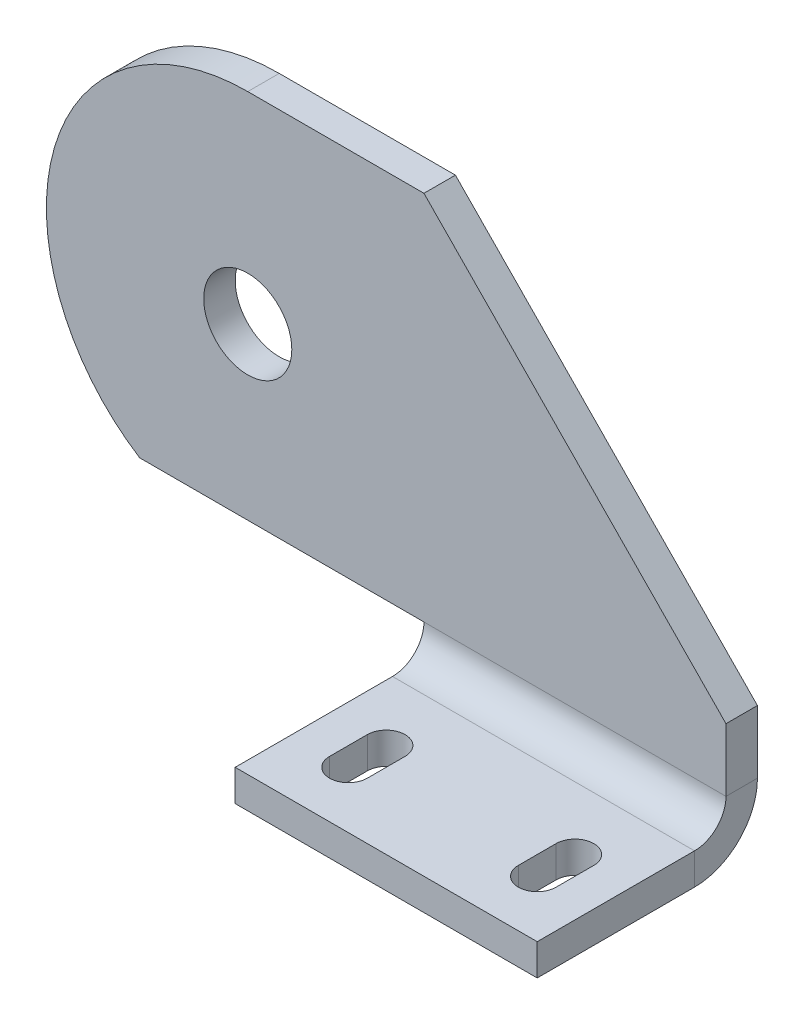
ISO-10303-21;
HEADER;
FILE_DESCRIPTION(('STEP AP214'),'2;1');
FILE_NAME('part.step','',(''),(''),'','','');
FILE_SCHEMA(('AUTOMOTIVE_DESIGN { 1 0 10303 214 1 1 1 1 }'));
ENDSEC;
DATA;
#1=APPLICATION_CONTEXT('core data for automotive mechanical design processes');
#2=APPLICATION_PROTOCOL_DEFINITION('international standard','automotive_design',2000,#1);
#3=PRODUCT_CONTEXT('',#1,'mechanical');
#4=PRODUCT('Part','Part','',(#3));
#5=PRODUCT_RELATED_PRODUCT_CATEGORY('part','',(#4));
#6=PRODUCT_DEFINITION_FORMATION('','',#4);
#7=PRODUCT_DEFINITION_CONTEXT('part definition',#1,'design');
#8=PRODUCT_DEFINITION('design','',#6,#7);
#9=PRODUCT_DEFINITION_SHAPE('','',#8);
#10=(LENGTH_UNIT() NAMED_UNIT(*) SI_UNIT(.MILLI.,.METRE.));
#11=(NAMED_UNIT(*) PLANE_ANGLE_UNIT() SI_UNIT($,.RADIAN.));
#12=(NAMED_UNIT(*) SI_UNIT($,.STERADIAN.) SOLID_ANGLE_UNIT());
#13=UNCERTAINTY_MEASURE_WITH_UNIT(LENGTH_MEASURE(1.E-05),#10,'distance_accuracy_value','');
#14=(GEOMETRIC_REPRESENTATION_CONTEXT(3) GLOBAL_UNCERTAINTY_ASSIGNED_CONTEXT((#13)) GLOBAL_UNIT_ASSIGNED_CONTEXT((#10,
#11,#12)) REPRESENTATION_CONTEXT('',''));
#15=CARTESIAN_POINT('',(0.,0.,0.));
#16=DIRECTION('',(0.,0.,1.));
#17=DIRECTION('',(1.,0.,0.));
#18=AXIS2_PLACEMENT_3D('',#15,#16,#17);
#19=CARTESIAN_POINT('',(-108.,0.,0.));
#20=DIRECTION('',(0.,0.,-1.));
#21=DIRECTION('',(-1.,0.,0.));
#22=AXIS2_PLACEMENT_3D('',#19,#20,#21);
#23=PLANE('',#22);
#24=CARTESIAN_POINT('',(-76.,32.,0.));
#25=DIRECTION('',(0.,0.,1.));
#26=DIRECTION('',(1.,0.,0.));
#27=AXIS2_PLACEMENT_3D('',#24,#25,#26);
#28=CIRCLE('',#27,7.);
#29=CARTESIAN_POINT('',(-69.,32.,0.));
#30=VERTEX_POINT('',#29);
#31=EDGE_CURVE('E201',#30,#30,#28,.T.);
#32=ORIENTED_EDGE('',*,*,#31,.F.);
#33=EDGE_LOOP('',(#32));
#34=FACE_BOUND('',#33,.T.);
#35=DIRECTION('',(0.699779834816443,-0.714358581375119,0.));
#36=VECTOR('',#35,1.);
#37=CARTESIAN_POINT('',(0.,15.,0.));
#38=LINE('',#37,#36);
#39=CARTESIAN_POINT('',(-48.,64.,0.));
#40=VERTEX_POINT('',#39);
#41=CARTESIAN_POINT('',(0.,15.,0.));
#42=VERTEX_POINT('',#41);
#43=EDGE_CURVE('E243',#40,#42,#38,.T.);
#44=ORIENTED_EDGE('',*,*,#43,.F.);
#45=DIRECTION('',(1.,0.,0.));
#46=VECTOR('',#45,1.);
#47=CARTESIAN_POINT('',(-108.,64.,0.));
#48=LINE('',#47,#46);
#49=CARTESIAN_POINT('',(-76.,64.,0.));
#50=VERTEX_POINT('',#49);
#51=EDGE_CURVE('E319',#50,#40,#48,.T.);
#52=ORIENTED_EDGE('',*,*,#51,.F.);
#53=CARTESIAN_POINT('',(-76.,32.,0.));
#54=DIRECTION('',(0.,0.,-1.));
#55=DIRECTION('',(1.,0.,0.));
#56=AXIS2_PLACEMENT_3D('',#53,#54,#55);
#57=CIRCLE('',#56,32.);
#58=CARTESIAN_POINT('',(-93.1755640373177,5.,0.));
#59=VERTEX_POINT('',#58);
#60=EDGE_CURVE('E262',#59,#50,#57,.T.);
#61=ORIENTED_EDGE('',*,*,#60,.F.);
#62=DIRECTION('',(1.,0.,0.));
#63=VECTOR('',#62,1.);
#64=CARTESIAN_POINT('',(-108.,5.,0.));
#65=LINE('',#64,#63);
#66=CARTESIAN_POINT('',(-48.,5.00000000000001,0.));
#67=VERTEX_POINT('',#66);
#68=EDGE_CURVE('E303',#59,#67,#65,.T.);
#69=ORIENTED_EDGE('',*,*,#68,.T.);
#70=CARTESIAN_POINT('',(0.,5.,0.));
#71=VERTEX_POINT('',#70);
#72=EDGE_CURVE('E302',#67,#71,#65,.T.);
#73=ORIENTED_EDGE('',*,*,#72,.T.);
#74=DIRECTION('',(0.,1.,0.));
#75=VECTOR('',#74,1.);
#76=CARTESIAN_POINT('',(0.,0.,0.));
#77=LINE('',#76,#75);
#78=EDGE_CURVE('E281',#71,#42,#77,.T.);
#79=ORIENTED_EDGE('',*,*,#78,.T.);
#80=EDGE_LOOP('',(#44,#52,#61,#69,#73,#79));
#81=FACE_BOUND('',#80,.T.);
#82=ADVANCED_FACE('F52',(#34,#81),#23,.F.);
#83=CARTESIAN_POINT('',(-108.,0.,-5.));
#84=DIRECTION('',(0.,0.,-1.));
#85=DIRECTION('',(-1.,0.,0.));
#86=AXIS2_PLACEMENT_3D('',#83,#84,#85);
#87=PLANE('',#86);
#88=CARTESIAN_POINT('',(-76.,32.,-5.));
#89=DIRECTION('',(0.,0.,1.));
#90=DIRECTION('',(1.,0.,0.));
#91=AXIS2_PLACEMENT_3D('',#88,#89,#90);
#92=CIRCLE('',#91,7.);
#93=CARTESIAN_POINT('',(-69.,32.,-5.));
#94=VERTEX_POINT('',#93);
#95=EDGE_CURVE('E208',#94,#94,#92,.T.);
#96=ORIENTED_EDGE('',*,*,#95,.T.);
#97=EDGE_LOOP('',(#96));
#98=FACE_BOUND('',#97,.T.);
#99=DIRECTION('',(1.,0.,0.));
#100=VECTOR('',#99,1.);
#101=CARTESIAN_POINT('',(-108.,64.,-5.));
#102=LINE('',#101,#100);
#103=CARTESIAN_POINT('',(-76.,64.,-5.));
#104=VERTEX_POINT('',#103);
#105=CARTESIAN_POINT('',(-48.,64.,-5.));
#106=VERTEX_POINT('',#105);
#107=EDGE_CURVE('E316',#104,#106,#102,.T.);
#108=ORIENTED_EDGE('',*,*,#107,.T.);
#109=DIRECTION('',(0.699779834816443,-0.714358581375119,0.));
#110=VECTOR('',#109,1.);
#111=CARTESIAN_POINT('',(0.,15.,-5.));
#112=LINE('',#111,#110);
#113=CARTESIAN_POINT('',(0.,15.,-5.));
#114=VERTEX_POINT('',#113);
#115=EDGE_CURVE('E250',#106,#114,#112,.T.);
#116=ORIENTED_EDGE('',*,*,#115,.T.);
#117=DIRECTION('',(0.,1.,0.));
#118=VECTOR('',#117,1.);
#119=CARTESIAN_POINT('',(0.,0.,-5.));
#120=LINE('',#119,#118);
#121=CARTESIAN_POINT('',(0.,5.,-5.));
#122=VERTEX_POINT('',#121);
#123=EDGE_CURVE('E284',#122,#114,#120,.T.);
#124=ORIENTED_EDGE('',*,*,#123,.F.);
#125=DIRECTION('',(1.,0.,0.));
#126=VECTOR('',#125,1.);
#127=CARTESIAN_POINT('',(-108.,5.,-5.));
#128=LINE('',#127,#126);
#129=CARTESIAN_POINT('',(-48.,5.00000000000001,-5.));
#130=VERTEX_POINT('',#129);
#131=EDGE_CURVE('E313',#130,#122,#128,.T.);
#132=ORIENTED_EDGE('',*,*,#131,.F.);
#133=CARTESIAN_POINT('',(-93.1755640373177,5.,-5.));
#134=VERTEX_POINT('',#133);
#135=EDGE_CURVE('E314',#134,#130,#128,.T.);
#136=ORIENTED_EDGE('',*,*,#135,.F.);
#137=CARTESIAN_POINT('',(-76.,32.,-5.));
#138=DIRECTION('',(0.,0.,-1.));
#139=DIRECTION('',(-1.,0.,0.));
#140=AXIS2_PLACEMENT_3D('',#137,#138,#139);
#141=CIRCLE('',#140,32.);
#142=EDGE_CURVE('E263',#134,#104,#141,.T.);
#143=ORIENTED_EDGE('',*,*,#142,.T.);
#144=EDGE_LOOP('',(#108,#116,#124,#132,#136,#143));
#145=FACE_BOUND('',#144,.T.);
#146=ADVANCED_FACE('F335',(#98,#145),#87,.T.);
#147=CARTESIAN_POINT('',(0.,-5.,5.));
#148=DIRECTION('',(1.,0.,0.));
#149=DIRECTION('',(0.,0.,-1.));
#150=AXIS2_PLACEMENT_3D('',#147,#148,#149);
#151=PLANE('',#150);
#152=ORIENTED_EDGE('',*,*,#123,.T.);
#153=DIRECTION('',(0.,0.,1.));
#154=VECTOR('',#153,1.);
#155=CARTESIAN_POINT('',(0.,15.,0.));
#156=LINE('',#155,#154);
#157=EDGE_CURVE('E253',#42,#114,#156,.F.);
#158=ORIENTED_EDGE('',*,*,#157,.F.);
#159=ORIENTED_EDGE('',*,*,#78,.F.);
#160=DIRECTION('',(0.,0.,-1.));
#161=VECTOR('',#160,1.);
#162=CARTESIAN_POINT('',(0.,5.,0.));
#163=LINE('',#162,#161);
#164=EDGE_CURVE('E60',#71,#122,#163,.T.);
#165=ORIENTED_EDGE('',*,*,#164,.T.);
#166=EDGE_LOOP('',(#152,#158,#159,#165));
#167=FACE_BOUND('',#166,.T.);
#168=ADVANCED_FACE('F329',(#167),#151,.T.);
#169=CARTESIAN_POINT('',(-108.,64.,-5.));
#170=DIRECTION('',(0.,1.,0.));
#171=DIRECTION('',(0.,0.,1.));
#172=AXIS2_PLACEMENT_3D('',#169,#170,#171);
#173=PLANE('',#172);
#174=ORIENTED_EDGE('',*,*,#51,.T.);
#175=DIRECTION('',(0.,0.,1.));
#176=VECTOR('',#175,1.);
#177=CARTESIAN_POINT('',(-48.,64.,0.));
#178=LINE('',#177,#176);
#179=EDGE_CURVE('E255',#40,#106,#178,.F.);
#180=ORIENTED_EDGE('',*,*,#179,.T.);
#181=ORIENTED_EDGE('',*,*,#107,.F.);
#182=DIRECTION('',(0.,0.,1.));
#183=VECTOR('',#182,1.);
#184=CARTESIAN_POINT('',(-76.,64.,0.));
#185=LINE('',#184,#183);
#186=EDGE_CURVE('E258',#50,#104,#185,.F.);
#187=ORIENTED_EDGE('',*,*,#186,.F.);
#188=EDGE_LOOP('',(#174,#180,#181,#187));
#189=FACE_BOUND('',#188,.T.);
#190=ADVANCED_FACE('F377',(#189),#173,.T.);
#191=CARTESIAN_POINT('',(-48.,5.00000000000001,-5.));
#192=DIRECTION('',(0.,1.,0.));
#193=DIRECTION('',(-1.,0.,0.));
#194=AXIS2_PLACEMENT_3D('',#191,#192,#193);
#195=PLANE('',#194);
#196=DIRECTION('',(0.,0.,1.));
#197=VECTOR('',#196,1.);
#198=CARTESIAN_POINT('',(-93.1755640373177,5.,0.));
#199=LINE('',#198,#197);
#200=EDGE_CURVE('E265',#59,#134,#199,.F.);
#201=ORIENTED_EDGE('',*,*,#200,.T.);
#202=ORIENTED_EDGE('',*,*,#135,.T.);
#203=DIRECTION('',(0.,0.,1.));
#204=VECTOR('',#203,1.);
#205=CARTESIAN_POINT('',(-48.,5.00000000000001,-5.));
#206=LINE('',#205,#204);
#207=EDGE_CURVE('E271',#130,#67,#206,.T.);
#208=ORIENTED_EDGE('',*,*,#207,.T.);
#209=ORIENTED_EDGE('',*,*,#68,.F.);
#210=EDGE_LOOP('',(#201,#202,#208,#209));
#211=FACE_BOUND('',#210,.T.);
#212=ADVANCED_FACE('F371',(#211),#195,.F.);
#213=CARTESIAN_POINT('',(0.,5.,0.));
#214=DIRECTION('',(1.,0.,0.));
#215=DIRECTION('',(0.,0.,-1.));
#216=AXIS2_PLACEMENT_3D('',#213,#214,#215);
#217=PLANE('',#216);
#218=ORIENTED_EDGE('',*,*,#164,.F.);
#219=CARTESIAN_POINT('',(0.,5.,5.));
#220=DIRECTION('',(-1.,0.,0.));
#221=DIRECTION('',(0.,0.,1.));
#222=AXIS2_PLACEMENT_3D('',#219,#220,#221);
#223=CIRCLE('',#222,5.);
#224=CARTESIAN_POINT('',(0.,0.,5.));
#225=VERTEX_POINT('',#224);
#226=EDGE_CURVE('E299',#225,#71,#223,.F.);
#227=ORIENTED_EDGE('',*,*,#226,.F.);
#228=DIRECTION('',(0.,1.,0.));
#229=VECTOR('',#228,1.);
#230=CARTESIAN_POINT('',(0.,-5.,5.));
#231=LINE('',#230,#229);
#232=CARTESIAN_POINT('',(0.,-5.,5.));
#233=VERTEX_POINT('',#232);
#234=EDGE_CURVE('E322',#233,#225,#231,.T.);
#235=ORIENTED_EDGE('',*,*,#234,.F.);
#236=CARTESIAN_POINT('',(0.,5.,5.));
#237=DIRECTION('',(-1.,0.,0.));
#238=DIRECTION('',(0.,0.,1.));
#239=AXIS2_PLACEMENT_3D('',#236,#237,#238);
#240=CIRCLE('',#239,10.);
#241=EDGE_CURVE('E287',#233,#122,#240,.F.);
#242=ORIENTED_EDGE('',*,*,#241,.T.);
#243=EDGE_LOOP('',(#218,#227,#235,#242));
#244=FACE_BOUND('',#243,.T.);
#245=ADVANCED_FACE('F54',(#244),#217,.T.);
#246=CARTESIAN_POINT('',(-108.,5.,5.));
#247=DIRECTION('',(1.,0.,0.));
#248=DIRECTION('',(0.,0.,-1.));
#249=AXIS2_PLACEMENT_3D('',#246,#247,#248);
#250=CYLINDRICAL_SURFACE('',#249,10.);
#251=CARTESIAN_POINT('',(-48.,5.,5.));
#252=DIRECTION('',(1.,0.,0.));
#253=DIRECTION('',(0.,0.,-1.));
#254=AXIS2_PLACEMENT_3D('',#251,#252,#253);
#255=CIRCLE('',#254,10.);
#256=CARTESIAN_POINT('',(-48.,-5.,5.));
#257=VERTEX_POINT('',#256);
#258=EDGE_CURVE('E279',#130,#257,#255,.F.);
#259=ORIENTED_EDGE('',*,*,#258,.F.);
#260=ORIENTED_EDGE('',*,*,#131,.T.);
#261=ORIENTED_EDGE('',*,*,#241,.F.);
#262=DIRECTION('',(1.,0.,0.));
#263=VECTOR('',#262,1.);
#264=CARTESIAN_POINT('',(-108.,-5.,5.));
#265=LINE('',#264,#263);
#266=EDGE_CURVE('E311',#257,#233,#265,.T.);
#267=ORIENTED_EDGE('',*,*,#266,.F.);
#268=EDGE_LOOP('',(#259,#260,#261,#267));
#269=FACE_BOUND('',#268,.T.);
#270=ADVANCED_FACE('F342',(#269),#250,.T.);
#271=CARTESIAN_POINT('',(-108.,-5.,30.));
#272=DIRECTION('',(0.,-1.,0.));
#273=DIRECTION('',(0.,0.,-1.));
#274=AXIS2_PLACEMENT_3D('',#271,#272,#273);
#275=PLANE('',#274);
#276=CARTESIAN_POINT('',(-9.00000000000001,-5.,15.));
#277=DIRECTION('',(0.,1.,0.));
#278=DIRECTION('',(0.,0.,1.));
#279=AXIS2_PLACEMENT_3D('',#276,#277,#278);
#280=CIRCLE('',#279,2.99999999999999);
#281=CARTESIAN_POINT('',(-6.00000000000001,-5.,15.));
#282=VERTEX_POINT('',#281);
#283=CARTESIAN_POINT('',(-12.,-5.,15.));
#284=VERTEX_POINT('',#283);
#285=EDGE_CURVE('E179',#282,#284,#280,.T.);
#286=ORIENTED_EDGE('',*,*,#285,.T.);
#287=DIRECTION('',(0.,0.,1.));
#288=VECTOR('',#287,1.);
#289=CARTESIAN_POINT('',(-12.,-5.,15.));
#290=LINE('',#289,#288);
#291=CARTESIAN_POINT('',(-12.,-5.,21.));
#292=VERTEX_POINT('',#291);
#293=EDGE_CURVE('E188',#284,#292,#290,.T.);
#294=ORIENTED_EDGE('',*,*,#293,.T.);
#295=CARTESIAN_POINT('',(-9.00000000000001,-5.,21.));
#296=DIRECTION('',(0.,1.,0.));
#297=DIRECTION('',(0.,0.,1.));
#298=AXIS2_PLACEMENT_3D('',#295,#296,#297);
#299=CIRCLE('',#298,2.99999999999999);
#300=CARTESIAN_POINT('',(-6.00000000000001,-5.,21.));
#301=VERTEX_POINT('',#300);
#302=EDGE_CURVE('E67',#292,#301,#299,.T.);
#303=ORIENTED_EDGE('',*,*,#302,.T.);
#304=DIRECTION('',(0.,0.,-1.));
#305=VECTOR('',#304,1.);
#306=CARTESIAN_POINT('',(-6.00000000000001,-5.,15.));
#307=LINE('',#306,#305);
#308=EDGE_CURVE('E185',#301,#282,#307,.T.);
#309=ORIENTED_EDGE('',*,*,#308,.T.);
#310=EDGE_LOOP('',(#286,#294,#303,#309));
#311=FACE_BOUND('',#310,.T.);
#312=CARTESIAN_POINT('',(-39.,-5.,15.));
#313=DIRECTION('',(0.,1.,0.));
#314=DIRECTION('',(0.,0.,1.));
#315=AXIS2_PLACEMENT_3D('',#312,#313,#314);
#316=CIRCLE('',#315,3.);
#317=CARTESIAN_POINT('',(-36.,-5.,15.));
#318=VERTEX_POINT('',#317);
#319=CARTESIAN_POINT('',(-42.,-5.,15.));
#320=VERTEX_POINT('',#319);
#321=EDGE_CURVE('E218',#318,#320,#316,.T.);
#322=ORIENTED_EDGE('',*,*,#321,.T.);
#323=DIRECTION('',(0.,0.,1.));
#324=VECTOR('',#323,1.);
#325=CARTESIAN_POINT('',(-42.,-5.,15.));
#326=LINE('',#325,#324);
#327=CARTESIAN_POINT('',(-42.,-5.,21.));
#328=VERTEX_POINT('',#327);
#329=EDGE_CURVE('E221',#320,#328,#326,.T.);
#330=ORIENTED_EDGE('',*,*,#329,.T.);
#331=CARTESIAN_POINT('',(-39.,-5.,21.));
#332=DIRECTION('',(0.,1.,0.));
#333=DIRECTION('',(0.,0.,1.));
#334=AXIS2_PLACEMENT_3D('',#331,#332,#333);
#335=CIRCLE('',#334,3.);
#336=CARTESIAN_POINT('',(-36.,-5.,21.));
#337=VERTEX_POINT('',#336);
#338=EDGE_CURVE('E225',#328,#337,#335,.T.);
#339=ORIENTED_EDGE('',*,*,#338,.T.);
#340=DIRECTION('',(0.,0.,-1.));
#341=VECTOR('',#340,1.);
#342=CARTESIAN_POINT('',(-36.,-5.,15.));
#343=LINE('',#342,#341);
#344=EDGE_CURVE('E228',#337,#318,#343,.T.);
#345=ORIENTED_EDGE('',*,*,#344,.T.);
#346=EDGE_LOOP('',(#322,#330,#339,#345));
#347=FACE_BOUND('',#346,.T.);
#348=DIRECTION('',(0.,0.,1.));
#349=VECTOR('',#348,1.);
#350=CARTESIAN_POINT('',(-48.,-5.,-5.));
#351=LINE('',#350,#349);
#352=CARTESIAN_POINT('',(-48.,-5.,30.));
#353=VERTEX_POINT('',#352);
#354=EDGE_CURVE('E272',#257,#353,#351,.T.);
#355=ORIENTED_EDGE('',*,*,#354,.F.);
#356=ORIENTED_EDGE('',*,*,#266,.T.);
#357=DIRECTION('',(0.,0.,-1.));
#358=VECTOR('',#357,1.);
#359=CARTESIAN_POINT('',(0.,-5.,30.));
#360=LINE('',#359,#358);
#361=CARTESIAN_POINT('',(0.,-5.,30.));
#362=VERTEX_POINT('',#361);
#363=EDGE_CURVE('E290',#362,#233,#360,.T.);
#364=ORIENTED_EDGE('',*,*,#363,.F.);
#365=DIRECTION('',(1.,0.,0.));
#366=VECTOR('',#365,1.);
#367=CARTESIAN_POINT('',(-108.,-5.,30.));
#368=LINE('',#367,#366);
#369=EDGE_CURVE('E309',#353,#362,#368,.T.);
#370=ORIENTED_EDGE('',*,*,#369,.F.);
#371=EDGE_LOOP('',(#355,#356,#364,#370));
#372=FACE_BOUND('',#371,.T.);
#373=ADVANCED_FACE('F192',(#311,#347,#372),#275,.T.);
#374=CARTESIAN_POINT('',(-108.,0.,30.));
#375=DIRECTION('',(0.,0.,1.));
#376=DIRECTION('',(1.,0.,0.));
#377=AXIS2_PLACEMENT_3D('',#374,#375,#376);
#378=PLANE('',#377);
#379=DIRECTION('',(0.,1.,0.));
#380=VECTOR('',#379,1.);
#381=CARTESIAN_POINT('',(-48.,-5.,30.));
#382=LINE('',#381,#380);
#383=CARTESIAN_POINT('',(-48.,0.,30.));
#384=VERTEX_POINT('',#383);
#385=EDGE_CURVE('E269',#353,#384,#382,.T.);
#386=ORIENTED_EDGE('',*,*,#385,.F.);
#387=ORIENTED_EDGE('',*,*,#369,.T.);
#388=DIRECTION('',(0.,-1.,0.));
#389=VECTOR('',#388,1.);
#390=CARTESIAN_POINT('',(0.,0.,30.));
#391=LINE('',#390,#389);
#392=CARTESIAN_POINT('',(0.,0.,30.));
#393=VERTEX_POINT('',#392);
#394=EDGE_CURVE('E293',#393,#362,#391,.T.);
#395=ORIENTED_EDGE('',*,*,#394,.F.);
#396=DIRECTION('',(1.,0.,0.));
#397=VECTOR('',#396,1.);
#398=CARTESIAN_POINT('',(-108.,0.,30.));
#399=LINE('',#398,#397);
#400=EDGE_CURVE('E307',#384,#393,#399,.T.);
#401=ORIENTED_EDGE('',*,*,#400,.F.);
#402=EDGE_LOOP('',(#386,#387,#395,#401));
#403=FACE_BOUND('',#402,.T.);
#404=ADVANCED_FACE('F357',(#403),#378,.T.);
#405=CARTESIAN_POINT('',(-108.,0.,30.));
#406=DIRECTION('',(0.,-1.,0.));
#407=DIRECTION('',(0.,0.,-1.));
#408=AXIS2_PLACEMENT_3D('',#405,#406,#407);
#409=PLANE('',#408);
#410=DIRECTION('',(0.,0.,1.));
#411=VECTOR('',#410,1.);
#412=CARTESIAN_POINT('',(-12.,0.,15.));
#413=LINE('',#412,#411);
#414=CARTESIAN_POINT('',(-12.,0.,15.));
#415=VERTEX_POINT('',#414);
#416=CARTESIAN_POINT('',(-12.,0.,21.));
#417=VERTEX_POINT('',#416);
#418=EDGE_CURVE('E207',#415,#417,#413,.T.);
#419=ORIENTED_EDGE('',*,*,#418,.F.);
#420=CARTESIAN_POINT('',(-9.00000000000001,0.,15.));
#421=DIRECTION('',(0.,1.,0.));
#422=DIRECTION('',(0.,0.,1.));
#423=AXIS2_PLACEMENT_3D('',#420,#421,#422);
#424=CIRCLE('',#423,2.99999999999999);
#425=CARTESIAN_POINT('',(-6.00000000000001,0.,15.));
#426=VERTEX_POINT('',#425);
#427=EDGE_CURVE('E75',#426,#415,#424,.T.);
#428=ORIENTED_EDGE('',*,*,#427,.F.);
#429=DIRECTION('',(0.,0.,-1.));
#430=VECTOR('',#429,1.);
#431=CARTESIAN_POINT('',(-6.00000000000001,0.,15.));
#432=LINE('',#431,#430);
#433=CARTESIAN_POINT('',(-6.00000000000001,0.,21.));
#434=VERTEX_POINT('',#433);
#435=EDGE_CURVE('E195',#434,#426,#432,.T.);
#436=ORIENTED_EDGE('',*,*,#435,.F.);
#437=CARTESIAN_POINT('',(-9.00000000000001,0.,21.));
#438=DIRECTION('',(0.,1.,0.));
#439=DIRECTION('',(0.,0.,1.));
#440=AXIS2_PLACEMENT_3D('',#437,#438,#439);
#441=CIRCLE('',#440,2.99999999999999);
#442=EDGE_CURVE('E198',#417,#434,#441,.T.);
#443=ORIENTED_EDGE('',*,*,#442,.F.);
#444=EDGE_LOOP('',(#419,#428,#436,#443));
#445=FACE_BOUND('',#444,.T.);
#446=DIRECTION('',(0.,0.,1.));
#447=VECTOR('',#446,1.);
#448=CARTESIAN_POINT('',(-42.,0.,15.));
#449=LINE('',#448,#447);
#450=CARTESIAN_POINT('',(-42.,0.,15.));
#451=VERTEX_POINT('',#450);
#452=CARTESIAN_POINT('',(-42.,0.,21.));
#453=VERTEX_POINT('',#452);
#454=EDGE_CURVE('E233',#451,#453,#449,.T.);
#455=ORIENTED_EDGE('',*,*,#454,.F.);
#456=CARTESIAN_POINT('',(-39.,0.,15.));
#457=DIRECTION('',(0.,1.,0.));
#458=DIRECTION('',(0.,0.,1.));
#459=AXIS2_PLACEMENT_3D('',#456,#457,#458);
#460=CIRCLE('',#459,3.);
#461=CARTESIAN_POINT('',(-36.,0.,15.));
#462=VERTEX_POINT('',#461);
#463=EDGE_CURVE('E214',#462,#451,#460,.T.);
#464=ORIENTED_EDGE('',*,*,#463,.F.);
#465=DIRECTION('',(0.,0.,-1.));
#466=VECTOR('',#465,1.);
#467=CARTESIAN_POINT('',(-36.,0.,15.));
#468=LINE('',#467,#466);
#469=CARTESIAN_POINT('',(-36.,0.,21.));
#470=VERTEX_POINT('',#469);
#471=EDGE_CURVE('E222',#470,#462,#468,.T.);
#472=ORIENTED_EDGE('',*,*,#471,.F.);
#473=CARTESIAN_POINT('',(-39.,0.,21.));
#474=DIRECTION('',(0.,1.,0.));
#475=DIRECTION('',(0.,0.,1.));
#476=AXIS2_PLACEMENT_3D('',#473,#474,#475);
#477=CIRCLE('',#476,3.);
#478=EDGE_CURVE('E236',#453,#470,#477,.T.);
#479=ORIENTED_EDGE('',*,*,#478,.F.);
#480=EDGE_LOOP('',(#455,#464,#472,#479));
#481=FACE_BOUND('',#480,.T.);
#482=DIRECTION('',(1.,0.,0.));
#483=VECTOR('',#482,1.);
#484=CARTESIAN_POINT('',(-108.,0.,5.));
#485=LINE('',#484,#483);
#486=CARTESIAN_POINT('',(-48.,0.,5.));
#487=VERTEX_POINT('',#486);
#488=EDGE_CURVE('E305',#487,#225,#485,.T.);
#489=ORIENTED_EDGE('',*,*,#488,.F.);
#490=DIRECTION('',(0.,0.,1.));
#491=VECTOR('',#490,1.);
#492=CARTESIAN_POINT('',(-48.,0.,30.));
#493=LINE('',#492,#491);
#494=EDGE_CURVE('E274',#487,#384,#493,.T.);
#495=ORIENTED_EDGE('',*,*,#494,.T.);
#496=ORIENTED_EDGE('',*,*,#400,.T.);
#497=DIRECTION('',(0.,0.,-1.));
#498=VECTOR('',#497,1.);
#499=CARTESIAN_POINT('',(0.,0.,30.));
#500=LINE('',#499,#498);
#501=EDGE_CURVE('E296',#393,#225,#500,.T.);
#502=ORIENTED_EDGE('',*,*,#501,.T.);
#503=EDGE_LOOP('',(#489,#495,#496,#502));
#504=FACE_BOUND('',#503,.T.);
#505=ADVANCED_FACE('F360',(#445,#481,#504),#409,.F.);
#506=CARTESIAN_POINT('',(-108.,5.,5.));
#507=DIRECTION('',(1.,0.,0.));
#508=DIRECTION('',(0.,0.,-1.));
#509=AXIS2_PLACEMENT_3D('',#506,#507,#508);
#510=CYLINDRICAL_SURFACE('',#509,5.);
#511=ORIENTED_EDGE('',*,*,#72,.F.);
#512=CARTESIAN_POINT('',(-48.,5.,5.));
#513=DIRECTION('',(1.,0.,0.));
#514=DIRECTION('',(0.,0.,-1.));
#515=AXIS2_PLACEMENT_3D('',#512,#513,#514);
#516=CIRCLE('',#515,5.);
#517=EDGE_CURVE('E14',#67,#487,#516,.F.);
#518=ORIENTED_EDGE('',*,*,#517,.T.);
#519=ORIENTED_EDGE('',*,*,#488,.T.);
#520=ORIENTED_EDGE('',*,*,#226,.T.);
#521=EDGE_LOOP('',(#511,#518,#519,#520));
#522=FACE_BOUND('',#521,.T.);
#523=ADVANCED_FACE('F364',(#522),#510,.F.);
#524=CARTESIAN_POINT('',(0.,5.,5.));
#525=DIRECTION('',(-1.,0.,0.));
#526=DIRECTION('',(0.,0.,1.));
#527=AXIS2_PLACEMENT_3D('',#524,#525,#526);
#528=PLANE('',#527);
#529=ORIENTED_EDGE('',*,*,#363,.T.);
#530=ORIENTED_EDGE('',*,*,#234,.T.);
#531=ORIENTED_EDGE('',*,*,#501,.F.);
#532=ORIENTED_EDGE('',*,*,#394,.T.);
#533=EDGE_LOOP('',(#529,#530,#531,#532));
#534=FACE_BOUND('',#533,.T.);
#535=ADVANCED_FACE('F345',(#534),#528,.F.);
#536=CARTESIAN_POINT('',(-48.,-5.,-5.));
#537=DIRECTION('',(1.,0.,0.));
#538=DIRECTION('',(0.,0.,-1.));
#539=AXIS2_PLACEMENT_3D('',#536,#537,#538);
#540=PLANE('',#539);
#541=ORIENTED_EDGE('',*,*,#258,.T.);
#542=ORIENTED_EDGE('',*,*,#354,.T.);
#543=ORIENTED_EDGE('',*,*,#385,.T.);
#544=ORIENTED_EDGE('',*,*,#494,.F.);
#545=ORIENTED_EDGE('',*,*,#517,.F.);
#546=ORIENTED_EDGE('',*,*,#207,.F.);
#547=EDGE_LOOP('',(#541,#542,#543,#544,#545,#546));
#548=FACE_BOUND('',#547,.T.);
#549=ADVANCED_FACE('F353',(#548),#540,.F.);
#550=CARTESIAN_POINT('',(-76.,32.,0.));
#551=DIRECTION('',(0.,0.,-1.));
#552=DIRECTION('',(-1.,0.,0.));
#553=AXIS2_PLACEMENT_3D('',#550,#551,#552);
#554=CYLINDRICAL_SURFACE('',#553,32.);
#555=ORIENTED_EDGE('',*,*,#200,.F.);
#556=ORIENTED_EDGE('',*,*,#60,.T.);
#557=ORIENTED_EDGE('',*,*,#186,.T.);
#558=ORIENTED_EDGE('',*,*,#142,.F.);
#559=EDGE_LOOP('',(#555,#556,#557,#558));
#560=FACE_BOUND('',#559,.T.);
#561=ADVANCED_FACE('F375',(#560),#554,.T.);
#562=CARTESIAN_POINT('',(0.,15.,0.));
#563=DIRECTION('',(0.714358581375119,0.699779834816443,0.));
#564=DIRECTION('',(0.699779834816443,-0.714358581375119,0.));
#565=AXIS2_PLACEMENT_3D('',#562,#563,#564);
#566=PLANE('',#565);
#567=ORIENTED_EDGE('',*,*,#179,.F.);
#568=ORIENTED_EDGE('',*,*,#43,.T.);
#569=ORIENTED_EDGE('',*,*,#157,.T.);
#570=ORIENTED_EDGE('',*,*,#115,.F.);
#571=EDGE_LOOP('',(#567,#568,#569,#570));
#572=FACE_BOUND('',#571,.T.);
#573=ADVANCED_FACE('F379',(#572),#566,.T.);
#574=CARTESIAN_POINT('',(-39.,-5.,15.));
#575=DIRECTION('',(0.,1.,0.));
#576=DIRECTION('',(0.,0.,1.));
#577=AXIS2_PLACEMENT_3D('',#574,#575,#576);
#578=CYLINDRICAL_SURFACE('',#577,3.);
#579=ORIENTED_EDGE('',*,*,#463,.T.);
#580=DIRECTION('',(0.,1.,0.));
#581=VECTOR('',#580,1.);
#582=CARTESIAN_POINT('',(-42.,-5.,15.));
#583=LINE('',#582,#581);
#584=EDGE_CURVE('E231',#320,#451,#583,.T.);
#585=ORIENTED_EDGE('',*,*,#584,.F.);
#586=ORIENTED_EDGE('',*,*,#321,.F.);
#587=DIRECTION('',(0.,1.,0.));
#588=VECTOR('',#587,1.);
#589=CARTESIAN_POINT('',(-36.,-5.,15.));
#590=LINE('',#589,#588);
#591=EDGE_CURVE('E241',#318,#462,#590,.T.);
#592=ORIENTED_EDGE('',*,*,#591,.T.);
#593=EDGE_LOOP('',(#579,#585,#586,#592));
#594=FACE_BOUND('',#593,.T.);
#595=ADVANCED_FACE('F381',(#594),#578,.F.);
#596=CARTESIAN_POINT('',(-36.,-5.,15.));
#597=DIRECTION('',(1.,0.,0.));
#598=DIRECTION('',(0.,0.,-1.));
#599=AXIS2_PLACEMENT_3D('',#596,#597,#598);
#600=PLANE('',#599);
#601=ORIENTED_EDGE('',*,*,#471,.T.);
#602=ORIENTED_EDGE('',*,*,#591,.F.);
#603=ORIENTED_EDGE('',*,*,#344,.F.);
#604=DIRECTION('',(0.,1.,0.));
#605=VECTOR('',#604,1.);
#606=CARTESIAN_POINT('',(-36.,-5.,21.));
#607=LINE('',#606,#605);
#608=EDGE_CURVE('E244',#337,#470,#607,.T.);
#609=ORIENTED_EDGE('',*,*,#608,.T.);
#610=EDGE_LOOP('',(#601,#602,#603,#609));
#611=FACE_BOUND('',#610,.T.);
#612=ADVANCED_FACE('F387',(#611),#600,.F.);
#613=CARTESIAN_POINT('',(-39.,-5.,21.));
#614=DIRECTION('',(0.,1.,0.));
#615=DIRECTION('',(0.,0.,1.));
#616=AXIS2_PLACEMENT_3D('',#613,#614,#615);
#617=CYLINDRICAL_SURFACE('',#616,3.);
#618=ORIENTED_EDGE('',*,*,#478,.T.);
#619=ORIENTED_EDGE('',*,*,#608,.F.);
#620=ORIENTED_EDGE('',*,*,#338,.F.);
#621=DIRECTION('',(0.,1.,0.));
#622=VECTOR('',#621,1.);
#623=CARTESIAN_POINT('',(-42.,-5.,21.));
#624=LINE('',#623,#622);
#625=EDGE_CURVE('E246',#328,#453,#624,.T.);
#626=ORIENTED_EDGE('',*,*,#625,.T.);
#627=EDGE_LOOP('',(#618,#619,#620,#626));
#628=FACE_BOUND('',#627,.T.);
#629=ADVANCED_FACE('F503',(#628),#617,.F.);
#630=CARTESIAN_POINT('',(-42.,-5.,15.));
#631=DIRECTION('',(-1.,0.,0.));
#632=DIRECTION('',(0.,0.,1.));
#633=AXIS2_PLACEMENT_3D('',#630,#631,#632);
#634=PLANE('',#633);
#635=ORIENTED_EDGE('',*,*,#454,.T.);
#636=ORIENTED_EDGE('',*,*,#625,.F.);
#637=ORIENTED_EDGE('',*,*,#329,.F.);
#638=ORIENTED_EDGE('',*,*,#584,.T.);
#639=EDGE_LOOP('',(#635,#636,#637,#638));
#640=FACE_BOUND('',#639,.T.);
#641=ADVANCED_FACE('F514',(#640),#634,.F.);
#642=CARTESIAN_POINT('',(-9.00000000000001,-5.,15.));
#643=DIRECTION('',(0.,1.,0.));
#644=DIRECTION('',(0.,0.,1.));
#645=AXIS2_PLACEMENT_3D('',#642,#643,#644);
#646=CYLINDRICAL_SURFACE('',#645,2.99999999999999);
#647=ORIENTED_EDGE('',*,*,#427,.T.);
#648=DIRECTION('',(0.,1.,0.));
#649=VECTOR('',#648,1.);
#650=CARTESIAN_POINT('',(-12.,-5.,15.));
#651=LINE('',#650,#649);
#652=EDGE_CURVE('E175',#284,#415,#651,.T.);
#653=ORIENTED_EDGE('',*,*,#652,.F.);
#654=ORIENTED_EDGE('',*,*,#285,.F.);
#655=DIRECTION('',(0.,1.,0.));
#656=VECTOR('',#655,1.);
#657=CARTESIAN_POINT('',(-6.00000000000001,-5.,15.));
#658=LINE('',#657,#656);
#659=EDGE_CURVE('E212',#282,#426,#658,.T.);
#660=ORIENTED_EDGE('',*,*,#659,.T.);
#661=EDGE_LOOP('',(#647,#653,#654,#660));
#662=FACE_BOUND('',#661,.T.);
#663=ADVANCED_FACE('F177',(#662),#646,.F.);
#664=CARTESIAN_POINT('',(-6.00000000000001,-5.,15.));
#665=DIRECTION('',(1.,0.,0.));
#666=DIRECTION('',(0.,0.,-1.));
#667=AXIS2_PLACEMENT_3D('',#664,#665,#666);
#668=PLANE('',#667);
#669=ORIENTED_EDGE('',*,*,#435,.T.);
#670=ORIENTED_EDGE('',*,*,#659,.F.);
#671=ORIENTED_EDGE('',*,*,#308,.F.);
#672=DIRECTION('',(0.,1.,0.));
#673=VECTOR('',#672,1.);
#674=CARTESIAN_POINT('',(-6.00000000000001,-5.,21.));
#675=LINE('',#674,#673);
#676=EDGE_CURVE('E215',#301,#434,#675,.T.);
#677=ORIENTED_EDGE('',*,*,#676,.T.);
#678=EDGE_LOOP('',(#669,#670,#671,#677));
#679=FACE_BOUND('',#678,.T.);
#680=ADVANCED_FACE('F535',(#679),#668,.F.);
#681=CARTESIAN_POINT('',(-9.00000000000001,-5.,21.));
#682=DIRECTION('',(0.,1.,0.));
#683=DIRECTION('',(0.,0.,1.));
#684=AXIS2_PLACEMENT_3D('',#681,#682,#683);
#685=CYLINDRICAL_SURFACE('',#684,2.99999999999999);
#686=ORIENTED_EDGE('',*,*,#442,.T.);
#687=ORIENTED_EDGE('',*,*,#676,.F.);
#688=ORIENTED_EDGE('',*,*,#302,.F.);
#689=DIRECTION('',(0.,1.,0.));
#690=VECTOR('',#689,1.);
#691=CARTESIAN_POINT('',(-12.,-5.,21.));
#692=LINE('',#691,#690);
#693=EDGE_CURVE('E184',#292,#417,#692,.T.);
#694=ORIENTED_EDGE('',*,*,#693,.T.);
#695=EDGE_LOOP('',(#686,#687,#688,#694));
#696=FACE_BOUND('',#695,.T.);
#697=ADVANCED_FACE('F545',(#696),#685,.F.);
#698=CARTESIAN_POINT('',(-12.,-5.,15.));
#699=DIRECTION('',(-1.,0.,0.));
#700=DIRECTION('',(0.,0.,1.));
#701=AXIS2_PLACEMENT_3D('',#698,#699,#700);
#702=PLANE('',#701);
#703=ORIENTED_EDGE('',*,*,#418,.T.);
#704=ORIENTED_EDGE('',*,*,#693,.F.);
#705=ORIENTED_EDGE('',*,*,#293,.F.);
#706=ORIENTED_EDGE('',*,*,#652,.T.);
#707=EDGE_LOOP('',(#703,#704,#705,#706));
#708=FACE_BOUND('',#707,.T.);
#709=ADVANCED_FACE('F189',(#708),#702,.F.);
#710=CARTESIAN_POINT('',(-76.,32.,-5.));
#711=DIRECTION('',(0.,0.,1.));
#712=DIRECTION('',(1.,0.,0.));
#713=AXIS2_PLACEMENT_3D('',#710,#711,#712);
#714=CYLINDRICAL_SURFACE('',#713,7.);
#715=ORIENTED_EDGE('',*,*,#95,.F.);
#716=EDGE_LOOP('',(#715));
#717=FACE_BOUND('',#716,.T.);
#718=ORIENTED_EDGE('',*,*,#31,.T.);
#719=EDGE_LOOP('',(#718));
#720=FACE_BOUND('',#719,.T.);
#721=ADVANCED_FACE('F564',(#717,#720),#714,.F.);
#722=CLOSED_SHELL('',(#82,#146,#168,#190,#212,#245,#270,#373,#404,#505,#523,#535,#549,#561,#573,
#595,#612,#629,#641,#663,#680,#697,#709,#721));
#723=MANIFOLD_SOLID_BREP('B2',#722);
#724=ADVANCED_BREP_SHAPE_REPRESENTATION('',(#18,#723),#14);
#725=SHAPE_DEFINITION_REPRESENTATION(#9,#724);
ENDSEC;
END-ISO-10303-21;
